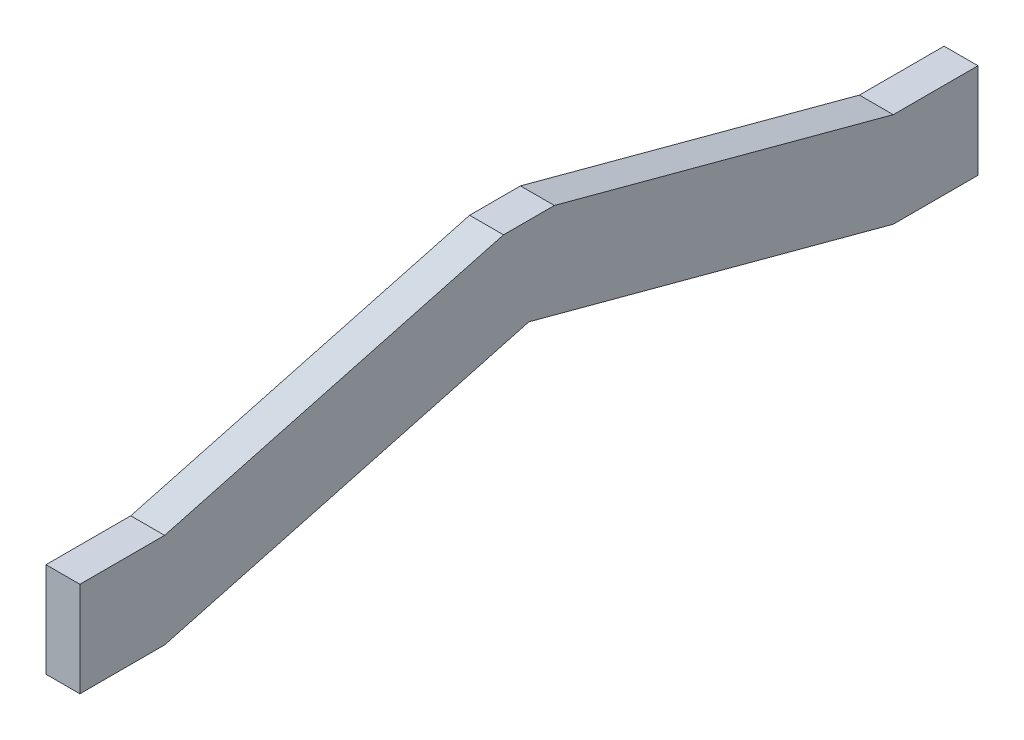
ISO-10303-21;
HEADER;
FILE_DESCRIPTION(('STEP AP214'),'2;1');
FILE_NAME('part.step','',(''),(''),'','','');
FILE_SCHEMA(('AUTOMOTIVE_DESIGN { 1 0 10303 214 1 1 1 1 }'));
ENDSEC;
DATA;
#1=APPLICATION_CONTEXT('core data for automotive mechanical design processes');
#2=APPLICATION_PROTOCOL_DEFINITION('international standard','automotive_design',2000,#1);
#3=PRODUCT_CONTEXT('',#1,'mechanical');
#4=PRODUCT('Part','Part','',(#3));
#5=PRODUCT_RELATED_PRODUCT_CATEGORY('part','',(#4));
#6=PRODUCT_DEFINITION_FORMATION('','',#4);
#7=PRODUCT_DEFINITION_CONTEXT('part definition',#1,'design');
#8=PRODUCT_DEFINITION('design','',#6,#7);
#9=PRODUCT_DEFINITION_SHAPE('','',#8);
#10=(LENGTH_UNIT() NAMED_UNIT(*) SI_UNIT(.MILLI.,.METRE.));
#11=(NAMED_UNIT(*) PLANE_ANGLE_UNIT() SI_UNIT($,.RADIAN.));
#12=(NAMED_UNIT(*) SI_UNIT($,.STERADIAN.) SOLID_ANGLE_UNIT());
#13=UNCERTAINTY_MEASURE_WITH_UNIT(LENGTH_MEASURE(1.E-05),#10,'distance_accuracy_value','');
#14=(GEOMETRIC_REPRESENTATION_CONTEXT(3) GLOBAL_UNCERTAINTY_ASSIGNED_CONTEXT((#13)) GLOBAL_UNIT_ASSIGNED_CONTEXT((#10,
#11,#12)) REPRESENTATION_CONTEXT('',''));
#15=CARTESIAN_POINT('',(0.,0.,0.));
#16=DIRECTION('',(0.,0.,1.));
#17=DIRECTION('',(1.,0.,0.));
#18=AXIS2_PLACEMENT_3D('',#15,#16,#17);
#19=CARTESIAN_POINT('',(10.,28.,0.));
#20=DIRECTION('',(0.,0.,1.));
#21=DIRECTION('',(0.,-1.,0.));
#22=AXIS2_PLACEMENT_3D('',#19,#20,#21);
#23=PLANE('',#22);
#24=DIRECTION('',(0.,1.,0.));
#25=VECTOR('',#24,1.);
#26=CARTESIAN_POINT('',(0.,28.,0.));
#27=LINE('',#26,#25);
#28=CARTESIAN_POINT('',(0.,0.,0.));
#29=VERTEX_POINT('',#28);
#30=CARTESIAN_POINT('',(0.,28.,0.));
#31=VERTEX_POINT('',#30);
#32=EDGE_CURVE('E146',#29,#31,#27,.T.);
#33=ORIENTED_EDGE('',*,*,#32,.T.);
#34=DIRECTION('',(-1.,0.,0.));
#35=VECTOR('',#34,1.);
#36=CARTESIAN_POINT('',(10.,28.,0.));
#37=LINE('',#36,#35);
#38=CARTESIAN_POINT('',(10.,28.,0.));
#39=VERTEX_POINT('',#38);
#40=EDGE_CURVE('E11',#39,#31,#37,.T.);
#41=ORIENTED_EDGE('',*,*,#40,.F.);
#42=DIRECTION('',(0.,1.,0.));
#43=VECTOR('',#42,1.);
#44=CARTESIAN_POINT('',(10.,28.,0.));
#45=LINE('',#44,#43);
#46=CARTESIAN_POINT('',(10.,0.,0.));
#47=VERTEX_POINT('',#46);
#48=EDGE_CURVE('E166',#47,#39,#45,.T.);
#49=ORIENTED_EDGE('',*,*,#48,.F.);
#50=DIRECTION('',(-1.,0.,0.));
#51=VECTOR('',#50,1.);
#52=CARTESIAN_POINT('',(10.,0.,0.));
#53=LINE('',#52,#51);
#54=EDGE_CURVE('E142',#47,#29,#53,.T.);
#55=ORIENTED_EDGE('',*,*,#54,.T.);
#56=EDGE_LOOP('',(#33,#41,#49,#55));
#57=FACE_BOUND('',#56,.T.);
#58=ADVANCED_FACE('F32',(#57),#23,.F.);
#59=CARTESIAN_POINT('',(10.,28.,25.));
#60=DIRECTION('',(0.,-1.,0.));
#61=DIRECTION('',(0.,0.,-1.));
#62=AXIS2_PLACEMENT_3D('',#59,#60,#61);
#63=PLANE('',#62);
#64=DIRECTION('',(0.,0.,1.));
#65=VECTOR('',#64,1.);
#66=CARTESIAN_POINT('',(0.,28.,25.));
#67=LINE('',#66,#65);
#68=CARTESIAN_POINT('',(0.,28.,25.));
#69=VERTEX_POINT('',#68);
#70=EDGE_CURVE('E149',#31,#69,#67,.T.);
#71=ORIENTED_EDGE('',*,*,#70,.T.);
#72=DIRECTION('',(-1.,0.,0.));
#73=VECTOR('',#72,1.);
#74=CARTESIAN_POINT('',(10.,28.,25.));
#75=LINE('',#74,#73);
#76=CARTESIAN_POINT('',(10.,28.,25.));
#77=VERTEX_POINT('',#76);
#78=EDGE_CURVE('E40',#77,#69,#75,.T.);
#79=ORIENTED_EDGE('',*,*,#78,.F.);
#80=DIRECTION('',(0.,0.,1.));
#81=VECTOR('',#80,1.);
#82=CARTESIAN_POINT('',(10.,28.,25.));
#83=LINE('',#82,#81);
#84=EDGE_CURVE('E100',#39,#77,#83,.T.);
#85=ORIENTED_EDGE('',*,*,#84,.F.);
#86=ORIENTED_EDGE('',*,*,#40,.T.);
#87=EDGE_LOOP('',(#71,#79,#85,#86));
#88=FACE_BOUND('',#87,.T.);
#89=ADVANCED_FACE('F238',(#88),#63,.F.);
#90=CARTESIAN_POINT('',(10.,54.7949192431123,125.));
#91=DIRECTION('',(0.,-0.965925826289068,0.258819045102522));
#92=DIRECTION('',(0.,-0.258819045102522,-0.965925826289068));
#93=AXIS2_PLACEMENT_3D('',#90,#91,#92);
#94=PLANE('',#93);
#95=DIRECTION('',(0.,0.258819045102522,0.965925826289068));
#96=VECTOR('',#95,1.);
#97=CARTESIAN_POINT('',(0.,54.7949192431123,125.));
#98=LINE('',#97,#96);
#99=CARTESIAN_POINT('',(0.,54.7949192431123,125.));
#100=VERTEX_POINT('',#99);
#101=EDGE_CURVE('E151',#69,#100,#98,.T.);
#102=ORIENTED_EDGE('',*,*,#101,.T.);
#103=DIRECTION('',(-1.,0.,0.));
#104=VECTOR('',#103,1.);
#105=CARTESIAN_POINT('',(10.,54.7949192431123,125.));
#106=LINE('',#105,#104);
#107=CARTESIAN_POINT('',(10.,54.7949192431123,125.));
#108=VERTEX_POINT('',#107);
#109=EDGE_CURVE('E182',#108,#100,#106,.T.);
#110=ORIENTED_EDGE('',*,*,#109,.F.);
#111=DIRECTION('',(0.,0.258819045102522,0.965925826289068));
#112=VECTOR('',#111,1.);
#113=CARTESIAN_POINT('',(10.,54.7949192431123,125.));
#114=LINE('',#113,#112);
#115=EDGE_CURVE('E190',#77,#108,#114,.T.);
#116=ORIENTED_EDGE('',*,*,#115,.F.);
#117=ORIENTED_EDGE('',*,*,#78,.T.);
#118=EDGE_LOOP('',(#102,#110,#116,#117));
#119=FACE_BOUND('',#118,.T.);
#120=ADVANCED_FACE('F188',(#119),#94,.F.);
#121=CARTESIAN_POINT('',(10.,54.7949192431123,140.));
#122=DIRECTION('',(0.,-1.,0.));
#123=DIRECTION('',(0.,0.,-1.));
#124=AXIS2_PLACEMENT_3D('',#121,#122,#123);
#125=PLANE('',#124);
#126=DIRECTION('',(0.,0.,1.));
#127=VECTOR('',#126,1.);
#128=CARTESIAN_POINT('',(0.,54.7949192431123,140.));
#129=LINE('',#128,#127);
#130=CARTESIAN_POINT('',(0.,54.7949192431123,140.));
#131=VERTEX_POINT('',#130);
#132=EDGE_CURVE('E153',#100,#131,#129,.T.);
#133=ORIENTED_EDGE('',*,*,#132,.T.);
#134=DIRECTION('',(-1.,0.,0.));
#135=VECTOR('',#134,1.);
#136=CARTESIAN_POINT('',(10.,54.7949192431123,140.));
#137=LINE('',#136,#135);
#138=CARTESIAN_POINT('',(10.,54.7949192431123,140.));
#139=VERTEX_POINT('',#138);
#140=EDGE_CURVE('E179',#139,#131,#137,.T.);
#141=ORIENTED_EDGE('',*,*,#140,.F.);
#142=DIRECTION('',(0.,0.,1.));
#143=VECTOR('',#142,1.);
#144=CARTESIAN_POINT('',(10.,54.7949192431123,140.));
#145=LINE('',#144,#143);
#146=EDGE_CURVE('E208',#108,#139,#145,.T.);
#147=ORIENTED_EDGE('',*,*,#146,.F.);
#148=ORIENTED_EDGE('',*,*,#109,.T.);
#149=EDGE_LOOP('',(#133,#141,#147,#148));
#150=FACE_BOUND('',#149,.T.);
#151=ADVANCED_FACE('F199',(#150),#125,.F.);
#152=CARTESIAN_POINT('',(10.,28.,240.));
#153=DIRECTION('',(0.,-0.965925826289068,-0.258819045102522));
#154=DIRECTION('',(0.,0.258819045102522,-0.965925826289068));
#155=AXIS2_PLACEMENT_3D('',#152,#153,#154);
#156=PLANE('',#155);
#157=DIRECTION('',(0.,-0.258819045102522,0.965925826289068));
#158=VECTOR('',#157,1.);
#159=CARTESIAN_POINT('',(0.,28.,240.));
#160=LINE('',#159,#158);
#161=CARTESIAN_POINT('',(0.,28.,240.));
#162=VERTEX_POINT('',#161);
#163=EDGE_CURVE('E155',#131,#162,#160,.T.);
#164=ORIENTED_EDGE('',*,*,#163,.T.);
#165=DIRECTION('',(-1.,0.,0.));
#166=VECTOR('',#165,1.);
#167=CARTESIAN_POINT('',(10.,28.,240.));
#168=LINE('',#167,#166);
#169=CARTESIAN_POINT('',(10.,28.,240.));
#170=VERTEX_POINT('',#169);
#171=EDGE_CURVE('E176',#170,#162,#168,.T.);
#172=ORIENTED_EDGE('',*,*,#171,.F.);
#173=DIRECTION('',(0.,-0.258819045102522,0.965925826289068));
#174=VECTOR('',#173,1.);
#175=CARTESIAN_POINT('',(10.,28.,240.));
#176=LINE('',#175,#174);
#177=EDGE_CURVE('E205',#139,#170,#176,.T.);
#178=ORIENTED_EDGE('',*,*,#177,.F.);
#179=ORIENTED_EDGE('',*,*,#140,.T.);
#180=EDGE_LOOP('',(#164,#172,#178,#179));
#181=FACE_BOUND('',#180,.T.);
#182=ADVANCED_FACE('F203',(#181),#156,.F.);
#183=CARTESIAN_POINT('',(10.,28.,265.));
#184=DIRECTION('',(0.,-1.,0.));
#185=DIRECTION('',(0.,0.,-1.));
#186=AXIS2_PLACEMENT_3D('',#183,#184,#185);
#187=PLANE('',#186);
#188=DIRECTION('',(0.,0.,1.));
#189=VECTOR('',#188,1.);
#190=CARTESIAN_POINT('',(0.,28.,265.));
#191=LINE('',#190,#189);
#192=CARTESIAN_POINT('',(0.,28.,265.));
#193=VERTEX_POINT('',#192);
#194=EDGE_CURVE('E157',#162,#193,#191,.T.);
#195=ORIENTED_EDGE('',*,*,#194,.T.);
#196=DIRECTION('',(-1.,0.,0.));
#197=VECTOR('',#196,1.);
#198=CARTESIAN_POINT('',(10.,28.,265.));
#199=LINE('',#198,#197);
#200=CARTESIAN_POINT('',(10.,28.,265.));
#201=VERTEX_POINT('',#200);
#202=EDGE_CURVE('E173',#201,#193,#199,.T.);
#203=ORIENTED_EDGE('',*,*,#202,.F.);
#204=DIRECTION('',(0.,0.,1.));
#205=VECTOR('',#204,1.);
#206=CARTESIAN_POINT('',(10.,28.,265.));
#207=LINE('',#206,#205);
#208=EDGE_CURVE('E207',#170,#201,#207,.T.);
#209=ORIENTED_EDGE('',*,*,#208,.F.);
#210=ORIENTED_EDGE('',*,*,#171,.T.);
#211=EDGE_LOOP('',(#195,#203,#209,#210));
#212=FACE_BOUND('',#211,.T.);
#213=ADVANCED_FACE('F251',(#212),#187,.F.);
#214=CARTESIAN_POINT('',(10.,0.,265.));
#215=DIRECTION('',(0.,0.,-1.));
#216=DIRECTION('',(-1.,0.,0.));
#217=AXIS2_PLACEMENT_3D('',#214,#215,#216);
#218=PLANE('',#217);
#219=DIRECTION('',(0.,-1.,0.));
#220=VECTOR('',#219,1.);
#221=CARTESIAN_POINT('',(0.,0.,265.));
#222=LINE('',#221,#220);
#223=CARTESIAN_POINT('',(0.,0.,265.));
#224=VERTEX_POINT('',#223);
#225=EDGE_CURVE('E159',#193,#224,#222,.T.);
#226=ORIENTED_EDGE('',*,*,#225,.T.);
#227=DIRECTION('',(-1.,0.,0.));
#228=VECTOR('',#227,1.);
#229=CARTESIAN_POINT('',(10.,0.,265.));
#230=LINE('',#229,#228);
#231=CARTESIAN_POINT('',(10.,0.,265.));
#232=VERTEX_POINT('',#231);
#233=EDGE_CURVE('E170',#232,#224,#230,.T.);
#234=ORIENTED_EDGE('',*,*,#233,.F.);
#235=DIRECTION('',(0.,-1.,0.));
#236=VECTOR('',#235,1.);
#237=CARTESIAN_POINT('',(10.,0.,265.));
#238=LINE('',#237,#236);
#239=EDGE_CURVE('E210',#201,#232,#238,.T.);
#240=ORIENTED_EDGE('',*,*,#239,.F.);
#241=ORIENTED_EDGE('',*,*,#202,.T.);
#242=EDGE_LOOP('',(#226,#234,#240,#241));
#243=FACE_BOUND('',#242,.T.);
#244=ADVANCED_FACE('F219',(#243),#218,.F.);
#245=CARTESIAN_POINT('',(10.,0.,240.));
#246=DIRECTION('',(0.,1.,0.));
#247=DIRECTION('',(0.,0.,1.));
#248=AXIS2_PLACEMENT_3D('',#245,#246,#247);
#249=PLANE('',#248);
#250=DIRECTION('',(0.,0.,-1.));
#251=VECTOR('',#250,1.);
#252=CARTESIAN_POINT('',(0.,0.,240.));
#253=LINE('',#252,#251);
#254=CARTESIAN_POINT('',(0.,0.,240.));
#255=VERTEX_POINT('',#254);
#256=EDGE_CURVE('E161',#224,#255,#253,.T.);
#257=ORIENTED_EDGE('',*,*,#256,.T.);
#258=DIRECTION('',(-1.,0.,0.));
#259=VECTOR('',#258,1.);
#260=CARTESIAN_POINT('',(10.,0.,240.));
#261=LINE('',#260,#259);
#262=CARTESIAN_POINT('',(10.,0.,240.));
#263=VERTEX_POINT('',#262);
#264=EDGE_CURVE('E137',#263,#255,#261,.T.);
#265=ORIENTED_EDGE('',*,*,#264,.F.);
#266=DIRECTION('',(0.,0.,-1.));
#267=VECTOR('',#266,1.);
#268=CARTESIAN_POINT('',(10.,0.,240.));
#269=LINE('',#268,#267);
#270=EDGE_CURVE('E128',#232,#263,#269,.T.);
#271=ORIENTED_EDGE('',*,*,#270,.F.);
#272=ORIENTED_EDGE('',*,*,#233,.T.);
#273=EDGE_LOOP('',(#257,#265,#271,#272));
#274=FACE_BOUND('',#273,.T.);
#275=ADVANCED_FACE('F223',(#274),#249,.F.);
#276=CARTESIAN_POINT('',(10.,28.8045381863458,132.5));
#277=DIRECTION('',(0.,0.965925826289068,0.258819045102522));
#278=DIRECTION('',(0.,-0.258819045102522,0.965925826289068));
#279=AXIS2_PLACEMENT_3D('',#276,#277,#278);
#280=PLANE('',#279);
#281=DIRECTION('',(0.,0.258819045102522,-0.965925826289068));
#282=VECTOR('',#281,1.);
#283=CARTESIAN_POINT('',(0.,28.8045381863458,132.5));
#284=LINE('',#283,#282);
#285=CARTESIAN_POINT('',(0.,28.8045381863458,132.5));
#286=VERTEX_POINT('',#285);
#287=EDGE_CURVE('E136',#255,#286,#284,.T.);
#288=ORIENTED_EDGE('',*,*,#287,.T.);
#289=DIRECTION('',(-1.,0.,0.));
#290=VECTOR('',#289,1.);
#291=CARTESIAN_POINT('',(10.,28.8045381863458,132.5));
#292=LINE('',#291,#290);
#293=CARTESIAN_POINT('',(10.,28.8045381863458,132.5));
#294=VERTEX_POINT('',#293);
#295=EDGE_CURVE('E133',#294,#286,#292,.T.);
#296=ORIENTED_EDGE('',*,*,#295,.F.);
#297=DIRECTION('',(0.,0.258819045102522,-0.965925826289068));
#298=VECTOR('',#297,1.);
#299=CARTESIAN_POINT('',(10.,28.8045381863458,132.5));
#300=LINE('',#299,#298);
#301=EDGE_CURVE('E122',#263,#294,#300,.T.);
#302=ORIENTED_EDGE('',*,*,#301,.F.);
#303=ORIENTED_EDGE('',*,*,#264,.T.);
#304=EDGE_LOOP('',(#288,#296,#302,#303));
#305=FACE_BOUND('',#304,.T.);
#306=ADVANCED_FACE('F134',(#305),#280,.F.);
#307=CARTESIAN_POINT('',(10.,0.,25.));
#308=DIRECTION('',(0.,0.965925826289068,-0.258819045102521));
#309=DIRECTION('',(0.,0.258819045102521,0.965925826289068));
#310=AXIS2_PLACEMENT_3D('',#307,#308,#309);
#311=PLANE('',#310);
#312=DIRECTION('',(0.,-0.258819045102521,-0.965925826289068));
#313=VECTOR('',#312,1.);
#314=CARTESIAN_POINT('',(0.,0.,25.));
#315=LINE('',#314,#313);
#316=CARTESIAN_POINT('',(0.,0.,25.));
#317=VERTEX_POINT('',#316);
#318=EDGE_CURVE('E86',#286,#317,#315,.T.);
#319=ORIENTED_EDGE('',*,*,#318,.T.);
#320=DIRECTION('',(-1.,0.,0.));
#321=VECTOR('',#320,1.);
#322=CARTESIAN_POINT('',(10.,0.,25.));
#323=LINE('',#322,#321);
#324=CARTESIAN_POINT('',(10.,0.,25.));
#325=VERTEX_POINT('',#324);
#326=EDGE_CURVE('E138',#325,#317,#323,.T.);
#327=ORIENTED_EDGE('',*,*,#326,.F.);
#328=DIRECTION('',(0.,-0.258819045102521,-0.965925826289068));
#329=VECTOR('',#328,1.);
#330=CARTESIAN_POINT('',(10.,0.,25.));
#331=LINE('',#330,#329);
#332=EDGE_CURVE('E126',#294,#325,#331,.T.);
#333=ORIENTED_EDGE('',*,*,#332,.F.);
#334=ORIENTED_EDGE('',*,*,#295,.T.);
#335=EDGE_LOOP('',(#319,#327,#333,#334));
#336=FACE_BOUND('',#335,.T.);
#337=ADVANCED_FACE('F140',(#336),#311,.F.);
#338=CARTESIAN_POINT('',(10.,0.,0.));
#339=DIRECTION('',(0.,1.,0.));
#340=DIRECTION('',(0.,0.,1.));
#341=AXIS2_PLACEMENT_3D('',#338,#339,#340);
#342=PLANE('',#341);
#343=DIRECTION('',(0.,0.,-1.));
#344=VECTOR('',#343,1.);
#345=CARTESIAN_POINT('',(0.,0.,0.));
#346=LINE('',#345,#344);
#347=EDGE_CURVE('E92',#317,#29,#346,.T.);
#348=ORIENTED_EDGE('',*,*,#347,.T.);
#349=ORIENTED_EDGE('',*,*,#54,.F.);
#350=DIRECTION('',(0.,0.,-1.));
#351=VECTOR('',#350,1.);
#352=CARTESIAN_POINT('',(10.,0.,0.));
#353=LINE('',#352,#351);
#354=EDGE_CURVE('E48',#325,#47,#353,.T.);
#355=ORIENTED_EDGE('',*,*,#354,.F.);
#356=ORIENTED_EDGE('',*,*,#326,.T.);
#357=EDGE_LOOP('',(#348,#349,#355,#356));
#358=FACE_BOUND('',#357,.T.);
#359=ADVANCED_FACE('F227',(#358),#342,.F.);
#360=CARTESIAN_POINT('',(10.,0.,0.));
#361=DIRECTION('',(-1.,0.,0.));
#362=DIRECTION('',(0.,0.,1.));
#363=AXIS2_PLACEMENT_3D('',#360,#361,#362);
#364=PLANE('',#363);
#365=ORIENTED_EDGE('',*,*,#48,.T.);
#366=ORIENTED_EDGE('',*,*,#84,.T.);
#367=ORIENTED_EDGE('',*,*,#115,.T.);
#368=ORIENTED_EDGE('',*,*,#146,.T.);
#369=ORIENTED_EDGE('',*,*,#177,.T.);
#370=ORIENTED_EDGE('',*,*,#208,.T.);
#371=ORIENTED_EDGE('',*,*,#239,.T.);
#372=ORIENTED_EDGE('',*,*,#270,.T.);
#373=ORIENTED_EDGE('',*,*,#301,.T.);
#374=ORIENTED_EDGE('',*,*,#332,.T.);
#375=ORIENTED_EDGE('',*,*,#354,.T.);
#376=EDGE_LOOP('',(#365,#366,#367,#368,#369,#370,#371,#372,#373,#374,#375));
#377=FACE_BOUND('',#376,.T.);
#378=ADVANCED_FACE('F124',(#377),#364,.F.);
#379=CARTESIAN_POINT('',(0.,0.,0.));
#380=DIRECTION('',(-1.,0.,0.));
#381=DIRECTION('',(0.,0.,1.));
#382=AXIS2_PLACEMENT_3D('',#379,#380,#381);
#383=PLANE('',#382);
#384=ORIENTED_EDGE('',*,*,#32,.F.);
#385=ORIENTED_EDGE('',*,*,#347,.F.);
#386=ORIENTED_EDGE('',*,*,#318,.F.);
#387=ORIENTED_EDGE('',*,*,#287,.F.);
#388=ORIENTED_EDGE('',*,*,#256,.F.);
#389=ORIENTED_EDGE('',*,*,#225,.F.);
#390=ORIENTED_EDGE('',*,*,#194,.F.);
#391=ORIENTED_EDGE('',*,*,#163,.F.);
#392=ORIENTED_EDGE('',*,*,#132,.F.);
#393=ORIENTED_EDGE('',*,*,#101,.F.);
#394=ORIENTED_EDGE('',*,*,#70,.F.);
#395=EDGE_LOOP('',(#384,#385,#386,#387,#388,#389,#390,#391,#392,#393,#394));
#396=FACE_BOUND('',#395,.T.);
#397=ADVANCED_FACE('F194',(#396),#383,.T.);
#398=CLOSED_SHELL('',(#58,#89,#120,#151,#182,#213,#244,#275,#306,#337,#359,#378,#397));
#399=MANIFOLD_SOLID_BREP('B2',#398);
#400=ADVANCED_BREP_SHAPE_REPRESENTATION('',(#18,#399),#14);
#401=SHAPE_DEFINITION_REPRESENTATION(#9,#400);
ENDSEC;
END-ISO-10303-21;
